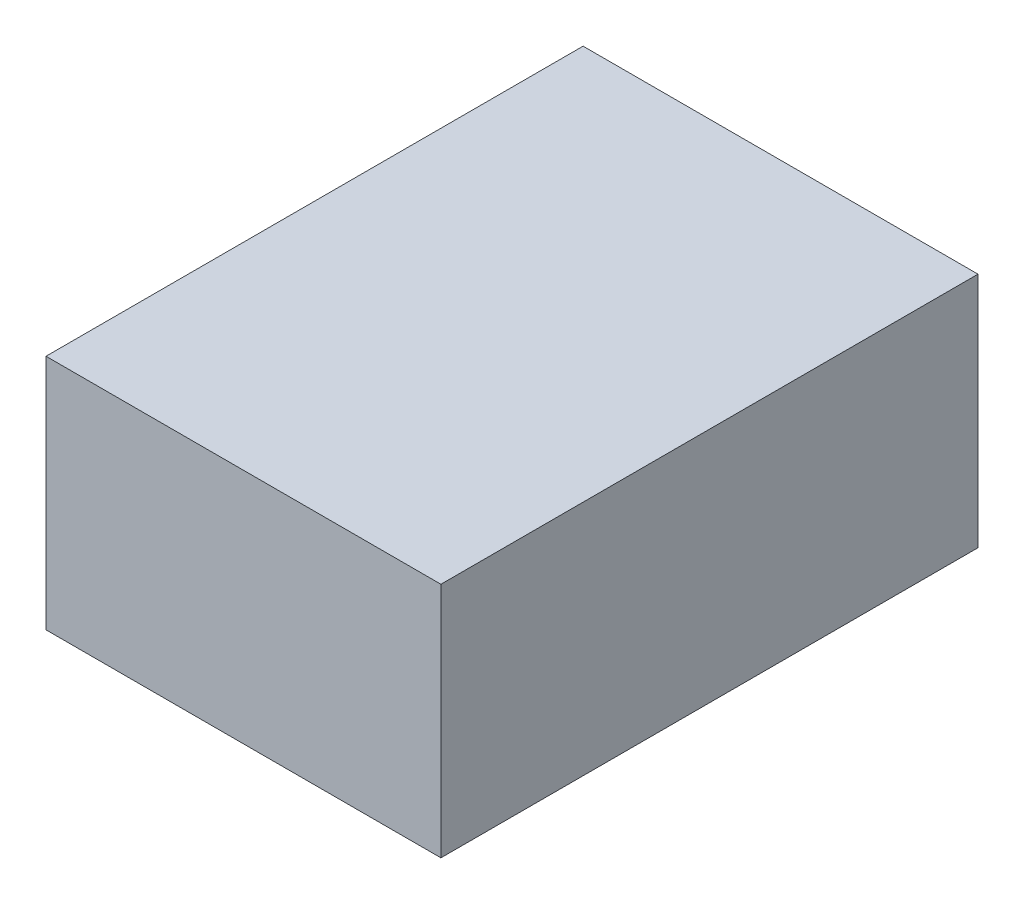
ISO-10303-21;
HEADER;
FILE_DESCRIPTION(('STEP AP214'),'2;1');
FILE_NAME('part.step','',(''),(''),'','','');
FILE_SCHEMA(('AUTOMOTIVE_DESIGN { 1 0 10303 214 1 1 1 1 }'));
ENDSEC;
DATA;
#1=APPLICATION_CONTEXT('core data for automotive mechanical design processes');
#2=APPLICATION_PROTOCOL_DEFINITION('international standard','automotive_design',2000,#1);
#3=PRODUCT_CONTEXT('',#1,'mechanical');
#4=PRODUCT('Part','Part','',(#3));
#5=PRODUCT_RELATED_PRODUCT_CATEGORY('part','',(#4));
#6=PRODUCT_DEFINITION_FORMATION('','',#4);
#7=PRODUCT_DEFINITION_CONTEXT('part definition',#1,'design');
#8=PRODUCT_DEFINITION('design','',#6,#7);
#9=PRODUCT_DEFINITION_SHAPE('','',#8);
#10=(LENGTH_UNIT() NAMED_UNIT(*) SI_UNIT(.MILLI.,.METRE.));
#11=(NAMED_UNIT(*) PLANE_ANGLE_UNIT() SI_UNIT($,.RADIAN.));
#12=(NAMED_UNIT(*) SI_UNIT($,.STERADIAN.) SOLID_ANGLE_UNIT());
#13=UNCERTAINTY_MEASURE_WITH_UNIT(LENGTH_MEASURE(1.E-05),#10,'distance_accuracy_value','');
#14=(GEOMETRIC_REPRESENTATION_CONTEXT(3) GLOBAL_UNCERTAINTY_ASSIGNED_CONTEXT((#13)) GLOBAL_UNIT_ASSIGNED_CONTEXT((#10,
#11,#12)) REPRESENTATION_CONTEXT('',''));
#15=CARTESIAN_POINT('',(0.,0.,0.));
#16=DIRECTION('',(0.,0.,1.));
#17=DIRECTION('',(1.,0.,0.));
#18=AXIS2_PLACEMENT_3D('',#15,#16,#17);
#19=CARTESIAN_POINT('',(0.,38.1,0.));
#20=DIRECTION('',(1.,0.,0.));
#21=DIRECTION('',(0.,0.,-1.));
#22=AXIS2_PLACEMENT_3D('',#19,#20,#21);
#23=PLANE('',#22);
#24=DIRECTION('',(0.,0.,1.));
#25=VECTOR('',#24,1.);
#26=CARTESIAN_POINT('',(0.,0.,0.));
#27=LINE('',#26,#25);
#28=CARTESIAN_POINT('',(0.,0.,-86.36));
#29=VERTEX_POINT('',#28);
#30=CARTESIAN_POINT('',(0.,0.,0.));
#31=VERTEX_POINT('',#30);
#32=EDGE_CURVE('E100',#29,#31,#27,.T.);
#33=ORIENTED_EDGE('',*,*,#32,.T.);
#34=DIRECTION('',(0.,-1.,0.));
#35=VECTOR('',#34,1.);
#36=CARTESIAN_POINT('',(0.,38.1,0.));
#37=LINE('',#36,#35);
#38=CARTESIAN_POINT('',(0.,38.1,0.));
#39=VERTEX_POINT('',#38);
#40=EDGE_CURVE('E11',#39,#31,#37,.T.);
#41=ORIENTED_EDGE('',*,*,#40,.F.);
#42=DIRECTION('',(0.,0.,1.));
#43=VECTOR('',#42,1.);
#44=CARTESIAN_POINT('',(0.,38.1,0.));
#45=LINE('',#44,#43);
#46=CARTESIAN_POINT('',(0.,38.1,-86.36));
#47=VERTEX_POINT('',#46);
#48=EDGE_CURVE('E88',#47,#39,#45,.T.);
#49=ORIENTED_EDGE('',*,*,#48,.F.);
#50=DIRECTION('',(0.,-1.,0.));
#51=VECTOR('',#50,1.);
#52=CARTESIAN_POINT('',(0.,38.1,-86.36));
#53=LINE('',#52,#51);
#54=EDGE_CURVE('E96',#47,#29,#53,.T.);
#55=ORIENTED_EDGE('',*,*,#54,.T.);
#56=EDGE_LOOP('',(#33,#41,#49,#55));
#57=FACE_BOUND('',#56,.T.);
#58=ADVANCED_FACE('F37',(#57),#23,.F.);
#59=CARTESIAN_POINT('',(0.,38.1,0.));
#60=DIRECTION('',(0.,0.,-1.));
#61=DIRECTION('',(-1.,0.,0.));
#62=AXIS2_PLACEMENT_3D('',#59,#60,#61);
#63=PLANE('',#62);
#64=DIRECTION('',(1.,0.,0.));
#65=VECTOR('',#64,1.);
#66=CARTESIAN_POINT('',(0.,0.,0.));
#67=LINE('',#66,#65);
#68=CARTESIAN_POINT('',(63.5,0.,0.));
#69=VERTEX_POINT('',#68);
#70=EDGE_CURVE('E92',#31,#69,#67,.T.);
#71=ORIENTED_EDGE('',*,*,#70,.T.);
#72=DIRECTION('',(0.,-1.,0.));
#73=VECTOR('',#72,1.);
#74=CARTESIAN_POINT('',(63.5,38.1,0.));
#75=LINE('',#74,#73);
#76=CARTESIAN_POINT('',(63.5,38.1,0.));
#77=VERTEX_POINT('',#76);
#78=EDGE_CURVE('E45',#77,#69,#75,.T.);
#79=ORIENTED_EDGE('',*,*,#78,.F.);
#80=DIRECTION('',(1.,0.,0.));
#81=VECTOR('',#80,1.);
#82=CARTESIAN_POINT('',(0.,38.1,0.));
#83=LINE('',#82,#81);
#84=EDGE_CURVE('E83',#39,#77,#83,.T.);
#85=ORIENTED_EDGE('',*,*,#84,.F.);
#86=ORIENTED_EDGE('',*,*,#40,.T.);
#87=EDGE_LOOP('',(#71,#79,#85,#86));
#88=FACE_BOUND('',#87,.T.);
#89=ADVANCED_FACE('F91',(#88),#63,.F.);
#90=CARTESIAN_POINT('',(63.5,38.1,0.));
#91=DIRECTION('',(-1.,0.,0.));
#92=DIRECTION('',(0.,0.,1.));
#93=AXIS2_PLACEMENT_3D('',#90,#91,#92);
#94=PLANE('',#93);
#95=DIRECTION('',(0.,0.,-1.));
#96=VECTOR('',#95,1.);
#97=CARTESIAN_POINT('',(63.5,0.,0.));
#98=LINE('',#97,#96);
#99=CARTESIAN_POINT('',(63.5,0.,-86.36));
#100=VERTEX_POINT('',#99);
#101=EDGE_CURVE('E70',#69,#100,#98,.T.);
#102=ORIENTED_EDGE('',*,*,#101,.T.);
#103=DIRECTION('',(0.,-1.,0.));
#104=VECTOR('',#103,1.);
#105=CARTESIAN_POINT('',(63.5,38.1,-86.36));
#106=LINE('',#105,#104);
#107=CARTESIAN_POINT('',(63.5,38.1,-86.36));
#108=VERTEX_POINT('',#107);
#109=EDGE_CURVE('E93',#108,#100,#106,.T.);
#110=ORIENTED_EDGE('',*,*,#109,.F.);
#111=DIRECTION('',(0.,0.,-1.));
#112=VECTOR('',#111,1.);
#113=CARTESIAN_POINT('',(63.5,38.1,0.));
#114=LINE('',#113,#112);
#115=EDGE_CURVE('E86',#77,#108,#114,.T.);
#116=ORIENTED_EDGE('',*,*,#115,.F.);
#117=ORIENTED_EDGE('',*,*,#78,.T.);
#118=EDGE_LOOP('',(#102,#110,#116,#117));
#119=FACE_BOUND('',#118,.T.);
#120=ADVANCED_FACE('F94',(#119),#94,.F.);
#121=CARTESIAN_POINT('',(0.,38.1,-86.36));
#122=DIRECTION('',(0.,0.,1.));
#123=DIRECTION('',(1.,0.,0.));
#124=AXIS2_PLACEMENT_3D('',#121,#122,#123);
#125=PLANE('',#124);
#126=DIRECTION('',(-1.,0.,0.));
#127=VECTOR('',#126,1.);
#128=CARTESIAN_POINT('',(0.,0.,-86.36));
#129=LINE('',#128,#127);
#130=EDGE_CURVE('E76',#100,#29,#129,.T.);
#131=ORIENTED_EDGE('',*,*,#130,.T.);
#132=ORIENTED_EDGE('',*,*,#54,.F.);
#133=DIRECTION('',(-1.,0.,0.));
#134=VECTOR('',#133,1.);
#135=CARTESIAN_POINT('',(0.,38.1,-86.36));
#136=LINE('',#135,#134);
#137=EDGE_CURVE('E53',#108,#47,#136,.T.);
#138=ORIENTED_EDGE('',*,*,#137,.F.);
#139=ORIENTED_EDGE('',*,*,#109,.T.);
#140=EDGE_LOOP('',(#131,#132,#138,#139));
#141=FACE_BOUND('',#140,.T.);
#142=ADVANCED_FACE('F107',(#141),#125,.F.);
#143=CARTESIAN_POINT('',(0.,38.1,0.));
#144=DIRECTION('',(0.,-1.,0.));
#145=DIRECTION('',(0.,0.,-1.));
#146=AXIS2_PLACEMENT_3D('',#143,#144,#145);
#147=PLANE('',#146);
#148=ORIENTED_EDGE('',*,*,#48,.T.);
#149=ORIENTED_EDGE('',*,*,#84,.T.);
#150=ORIENTED_EDGE('',*,*,#115,.T.);
#151=ORIENTED_EDGE('',*,*,#137,.T.);
#152=EDGE_LOOP('',(#148,#149,#150,#151));
#153=FACE_BOUND('',#152,.T.);
#154=ADVANCED_FACE('F84',(#153),#147,.F.);
#155=CARTESIAN_POINT('',(0.,0.,0.));
#156=DIRECTION('',(0.,-1.,0.));
#157=DIRECTION('',(0.,0.,-1.));
#158=AXIS2_PLACEMENT_3D('',#155,#156,#157);
#159=PLANE('',#158);
#160=ORIENTED_EDGE('',*,*,#32,.F.);
#161=ORIENTED_EDGE('',*,*,#130,.F.);
#162=ORIENTED_EDGE('',*,*,#101,.F.);
#163=ORIENTED_EDGE('',*,*,#70,.F.);
#164=EDGE_LOOP('',(#160,#161,#162,#163));
#165=FACE_BOUND('',#164,.T.);
#166=ADVANCED_FACE('F110',(#165),#159,.T.);
#167=CLOSED_SHELL('',(#58,#89,#120,#142,#154,#166));
#168=MANIFOLD_SOLID_BREP('B2',#167);
#169=ADVANCED_BREP_SHAPE_REPRESENTATION('',(#18,#168),#14);
#170=SHAPE_DEFINITION_REPRESENTATION(#9,#169);
ENDSEC;
END-ISO-10303-21;
